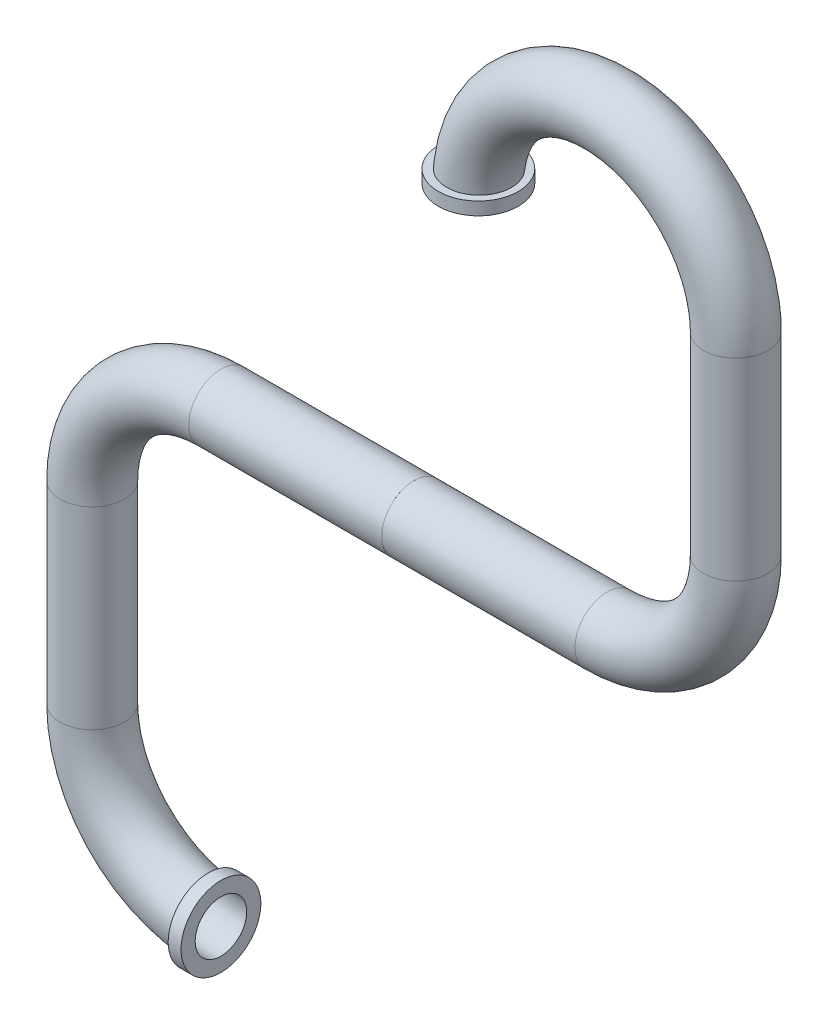
ISO-10303-21;
HEADER;
FILE_DESCRIPTION(('STEP AP214'),'2;1');
FILE_NAME('part.step','',(''),(''),'','','');
FILE_SCHEMA(('AUTOMOTIVE_DESIGN { 1 0 10303 214 1 1 1 1 }'));
ENDSEC;
DATA;
#1=APPLICATION_CONTEXT('core data for automotive mechanical design processes');
#2=APPLICATION_PROTOCOL_DEFINITION('international standard','automotive_design',2000,#1);
#3=PRODUCT_CONTEXT('',#1,'mechanical');
#4=PRODUCT('Part','Part','',(#3));
#5=PRODUCT_RELATED_PRODUCT_CATEGORY('part','',(#4));
#6=PRODUCT_DEFINITION_FORMATION('','',#4);
#7=PRODUCT_DEFINITION_CONTEXT('part definition',#1,'design');
#8=PRODUCT_DEFINITION('design','',#6,#7);
#9=PRODUCT_DEFINITION_SHAPE('','',#8);
#10=(LENGTH_UNIT() NAMED_UNIT(*) SI_UNIT(.MILLI.,.METRE.));
#11=(NAMED_UNIT(*) PLANE_ANGLE_UNIT() SI_UNIT($,.RADIAN.));
#12=(NAMED_UNIT(*) SI_UNIT($,.STERADIAN.) SOLID_ANGLE_UNIT());
#13=UNCERTAINTY_MEASURE_WITH_UNIT(LENGTH_MEASURE(1.E-05),#10,'distance_accuracy_value','');
#14=(GEOMETRIC_REPRESENTATION_CONTEXT(3) GLOBAL_UNCERTAINTY_ASSIGNED_CONTEXT((#13)) GLOBAL_UNIT_ASSIGNED_CONTEXT((#10,
#11,#12)) REPRESENTATION_CONTEXT('',''));
#15=CARTESIAN_POINT('',(0.,0.,0.));
#16=DIRECTION('',(0.,0.,1.));
#17=DIRECTION('',(1.,0.,0.));
#18=AXIS2_PLACEMENT_3D('',#15,#16,#17);
#19=CARTESIAN_POINT('',(-1.,-5.,0.));
#20=DIRECTION('',(0.,0.,1.));
#21=DIRECTION('',(-1.,0.,0.));
#22=AXIS2_PLACEMENT_3D('',#19,#20,#21);
#23=TOROIDAL_SURFACE('',#22,1.,0.25);
#24=CARTESIAN_POINT('',(-2.,-5.,0.));
#25=DIRECTION('',(0.,1.,0.));
#26=DIRECTION('',(1.,0.,0.));
#27=AXIS2_PLACEMENT_3D('',#24,#25,#26);
#28=CIRCLE('',#27,0.25);
#29=CARTESIAN_POINT('',(-1.75,-5.,0.));
#30=VERTEX_POINT('',#29);
#31=EDGE_CURVE('E69',#30,#30,#28,.T.);
#32=ORIENTED_EDGE('',*,*,#31,.F.);
#33=EDGE_LOOP('',(#32));
#34=FACE_BOUND('',#33,.T.);
#35=CARTESIAN_POINT('',(-1.1,-5.79859890368239,0.156239637939032));
#36=CARTESIAN_POINT('',(-1.1,-5.80748461825524,0.167252077609556));
#37=CARTESIAN_POINT('',(-1.1,-5.81731154482602,0.177518916216268));
#38=CARTESIAN_POINT('',(-1.1,-5.83855979360369,0.19626373386054));
#39=CARTESIAN_POINT('',(-1.1,-5.84998316824432,0.204739374280286));
#40=CARTESIAN_POINT('',(-1.1,-5.87408196910666,0.219650591642867));
#41=CARTESIAN_POINT('',(-1.1,-5.886756519343,0.22608758280258));
#42=CARTESIAN_POINT('',(-1.1,-5.91300023448786,0.236747922206662));
#43=CARTESIAN_POINT('',(-1.1,-5.92656916374023,0.240971850957401));
#44=CARTESIAN_POINT('',(-1.1,-5.95426609808908,0.247100376432837));
#45=CARTESIAN_POINT('',(-1.1,-5.96839572582249,0.248997644239239));
#46=CARTESIAN_POINT('',(-1.1,-5.99677370794496,0.250392904432415));
#47=CARTESIAN_POINT('',(-1.1,-6.01102206788375,0.249890784032795));
#48=CARTESIAN_POINT('',(-1.1,-6.03922913334701,0.246498215551292));
#49=CARTESIAN_POINT('',(-1.1,-6.0531878915475,0.243608205779817));
#50=CARTESIAN_POINT('',(-1.1,-6.08041932555233,0.235518387043977));
#51=CARTESIAN_POINT('',(-1.1,-6.09369201220857,0.230318614626648));
#52=CARTESIAN_POINT('',(-1.1,-6.11913001861259,0.217773097139474));
#53=CARTESIAN_POINT('',(-1.1,-6.13129864492456,0.210434057268859));
#54=CARTESIAN_POINT('',(-1.1,-6.15422440361082,0.193809388757354));
#55=CARTESIAN_POINT('',(-1.1,-6.16498156794405,0.184523804203341));
#56=CARTESIAN_POINT('',(-1.1,-6.18473296660521,0.164309957154052));
#57=CARTESIAN_POINT('',(-1.1,-6.19373414042714,0.153388475286201));
#58=CARTESIAN_POINT('',(-1.1,-6.20976742880129,0.130184858647969));
#59=CARTESIAN_POINT('',(-1.1,-6.2167995799634,0.117902749181559));
#60=CARTESIAN_POINT('',(-1.1,-6.22866989147601,0.0923732303855355));
#61=CARTESIAN_POINT('',(-1.1,-6.23351568693935,0.079129370795629));
#62=CARTESIAN_POINT('',(-1.1,-6.24090948117469,0.0520150874536668));
#63=CARTESIAN_POINT('',(-1.1,-6.24345751315272,0.0381446727592879));
#64=CARTESIAN_POINT('',(-1.1,-6.24617903253143,0.0102038849674102));
#65=CARTESIAN_POINT('',(-1.1,-6.24635775803878,-0.00386597816707667));
#66=CARTESIAN_POINT('',(-1.1,-6.2443490557881,-0.031835709221199));
#67=CARTESIAN_POINT('',(-1.1,-6.24216164206245,-0.0457355781484911));
#68=CARTESIAN_POINT('',(-1.1,-6.23548566564956,-0.0729628531749742));
#69=CARTESIAN_POINT('',(-1.1,-6.23099839651049,-0.0862905765141949));
#70=CARTESIAN_POINT('',(-1.1,-6.21985250641525,-0.112004722408374));
#71=CARTESIAN_POINT('',(-1.1,-6.2131938798134,-0.124391142515778));
#72=CARTESIAN_POINT('',(-1.1,-6.19788731542389,-0.147887218294693));
#73=CARTESIAN_POINT('',(-1.1,-6.18923708938564,-0.158995383124068));
#74=CARTESIAN_POINT('',(-1.1,-6.17019911655826,-0.179606640126383));
#75=CARTESIAN_POINT('',(-1.1,-6.15981135014478,-0.189109714168483));
#76=CARTESIAN_POINT('',(-1.1,-6.13756371948689,-0.20626946017412));
#77=CARTESIAN_POINT('',(-1.1,-6.1256999380033,-0.21392105304271));
#78=CARTESIAN_POINT('',(-1.1,-6.1008600065118,-0.227132541762682));
#79=CARTESIAN_POINT('',(-1.1,-6.08788383586549,-0.232692398795326));
#80=CARTESIAN_POINT('',(-1.1,-6.06113487356717,-0.241585432017922));
#81=CARTESIAN_POINT('',(-1.1,-6.04735924079537,-0.244910062193764));
#82=CARTESIAN_POINT('',(-1.1,-6.01944604647422,-0.249209299271455));
#83=CARTESIAN_POINT('',(-1.1,-6.00530847649481,-0.250183851386056));
#84=CARTESIAN_POINT('',(-1.1,-5.9770136765723,-0.249758171980902));
#85=CARTESIAN_POINT('',(-1.1,-5.96285658644129,-0.248348625861448));
#86=CARTESIAN_POINT('',(-1.1,-5.93497822630541,-0.243178774257271));
#87=CARTESIAN_POINT('',(-1.1,-5.92125696445682,-0.239418424805888));
#88=CARTESIAN_POINT('',(-1.1,-5.89460613735038,-0.229641253917755));
#89=CARTESIAN_POINT('',(-1.1,-5.88167853001149,-0.223619093935796));
#90=CARTESIAN_POINT('',(-1.1,-5.85701911324203,-0.209487505095448));
#91=CARTESIAN_POINT('',(-1.1,-5.8452873095212,-0.201378066271353));
#92=CARTESIAN_POINT('',(-1.1,-5.82337073898221,-0.183309172670582));
#93=CARTESIAN_POINT('',(-1.1,-5.81318412058785,-0.173351964393614));
#94=CARTESIAN_POINT('',(-1.1,-5.79463870405255,-0.151859949096213));
#95=CARTESIAN_POINT('',(-1.1,-5.78627985742117,-0.140325183941277));
#96=CARTESIAN_POINT('',(-1.1,-5.77168127958962,-0.116074864617476));
#97=CARTESIAN_POINT('',(-1.1,-5.76542965254311,-0.103366473106763));
#98=CARTESIAN_POINT('',(-1.1,-5.75516854334937,-0.0770751991823504));
#99=CARTESIAN_POINT('',(-1.1,-5.75115885665188,-0.0634923966743455));
#100=CARTESIAN_POINT('',(-1.1,-5.74552688282323,-0.035954544226516));
#101=CARTESIAN_POINT('',(-1.1,-5.74388566967865,-0.0220033627581954));
#102=CARTESIAN_POINT('',(-1.1,-5.74298034692899,0.00597955267886069));
#103=CARTESIAN_POINT('',(-1.1,-5.74371675742366,0.0200113036018034));
#104=CARTESIAN_POINT('',(-1.1,-5.74753647692591,0.0476924426773993));
#105=CARTESIAN_POINT('',(-1.1,-5.75061036534622,0.0613431382070314));
#106=CARTESIAN_POINT('',(-1.1,-5.7589995811081,0.0879247327921834));
#107=CARTESIAN_POINT('',(-1.1,-5.76431221334144,0.10085647623827));
#108=CARTESIAN_POINT('',(-1.1,-5.77456413039254,0.120867695525481));
#109=CARTESIAN_POINT('',(-1.1,-5.7788601779382,0.128284026486018));
#110=CARTESIAN_POINT('',(-1.1,-5.78818888620585,0.142637803870604));
#111=CARTESIAN_POINT('',(-1.1,-5.79322154516689,0.149575251439416));
#112=CARTESIAN_POINT('',(-1.1,-5.79859890368239,0.156239637939032));
#113=B_SPLINE_CURVE_WITH_KNOTS('',3,(#35,#36,#37,#38,#39,#40,#41,#42,#43,#44,#45,#46,#47,#48,
#49,#50,#51,#52,#53,#54,#55,#56,#57,#58,#59,#60,#61,#62,#63,#64,#65,#66,#67,#68,#69,#70,#71,#72,
#73,#74,#75,#76,#77,#78,#79,#80,#81,#82,#83,#84,#85,#86,#87,#88,#89,#90,#91,#92,#93,#94,#95,#96,
#97,#98,#99,#100,#101,#102,#103,#104,#105,#106,#107,#108,#109,#110,#111,#112),.UNSPECIFIED.,.T.,
.F.,(4,2,2,2,2,2,2,2,2,2,2,2,2,2,2,2,2,2,2,2,2,2,2,2,2,2,2,2,2,2,2,2,2,2,2,2,2,2,4),(0.,
0.0424192772184811,0.0848936001837856,0.127338393721263,0.16977204802275,0.212339026654769,
0.254908006223218,0.297469173753552,0.340029667868764,0.382458171419216,0.424885714119334,
0.467142031024321,0.509397562208715,0.551504365817851,0.593610560912517,0.635623651286504,
0.677636492503143,0.719625729586843,0.761615075846239,0.803652908716626,0.845691216407668,
0.887843570926039,0.929996707675383,0.972310107021949,1.01462449280908,1.05710458176961,
1.09958546525149,1.14216725288102,1.18474924382094,1.22727979920904,1.26980922613231,
1.3120943759003,1.35437566702383,1.39631718923709,1.43826788668425,1.48005040315259,
1.52178276285504,1.54745365347394,1.57312448272488),.UNSPECIFIED.);
#114=CARTESIAN_POINT('',(-1.1,-5.79859890368239,0.156239637939032));
#115=VERTEX_POINT('',#114);
#116=EDGE_CURVE('E12',#115,#115,#113,.T.);
#117=ORIENTED_EDGE('',*,*,#116,.F.);
#118=EDGE_LOOP('',(#117));
#119=FACE_BOUND('',#118,.T.);
#120=ADVANCED_FACE('F39',(#34,#119),#23,.T.);
#121=CARTESIAN_POINT('',(0.5,-5.,0.));
#122=DIRECTION('',(1.,0.,0.));
#123=DIRECTION('',(0.,0.,1.));
#124=AXIS2_PLACEMENT_3D('',#121,#122,#123);
#125=PLANE('',#124);
#126=CARTESIAN_POINT('',(0.5,-2.5,0.));
#127=DIRECTION('',(1.,0.,0.));
#128=DIRECTION('',(0.,0.,1.));
#129=AXIS2_PLACEMENT_3D('',#126,#127,#128);
#130=CIRCLE('',#129,0.2);
#131=CARTESIAN_POINT('',(0.5,-2.5,0.2));
#132=VERTEX_POINT('',#131);
#133=EDGE_CURVE('E59',#132,#132,#130,.F.);
#134=ORIENTED_EDGE('',*,*,#133,.T.);
#135=EDGE_LOOP('',(#134));
#136=FACE_BOUND('',#135,.T.);
#137=CARTESIAN_POINT('',(0.5,-2.5,0.));
#138=DIRECTION('',(1.,0.,0.));
#139=DIRECTION('',(0.,0.,1.));
#140=AXIS2_PLACEMENT_3D('',#137,#138,#139);
#141=CIRCLE('',#140,0.25);
#142=CARTESIAN_POINT('',(0.5,-2.5,0.25));
#143=VERTEX_POINT('',#142);
#144=EDGE_CURVE('E54',#143,#143,#141,.F.);
#145=ORIENTED_EDGE('',*,*,#144,.F.);
#146=EDGE_LOOP('',(#145));
#147=FACE_BOUND('',#146,.T.);
#148=ADVANCED_FACE('F116',(#136,#147),#125,.T.);
#149=CARTESIAN_POINT('',(-1.,-2.5,0.));
#150=DIRECTION('',(1.,0.,0.));
#151=DIRECTION('',(0.,-1.,0.));
#152=AXIS2_PLACEMENT_3D('',#149,#150,#151);
#153=CYLINDRICAL_SURFACE('',#152,0.25);
#154=CARTESIAN_POINT('',(-1.,-2.5,0.));
#155=DIRECTION('',(1.,0.,0.));
#156=DIRECTION('',(0.,-1.,0.));
#157=AXIS2_PLACEMENT_3D('',#154,#155,#156);
#158=CIRCLE('',#157,0.25);
#159=CARTESIAN_POINT('',(-1.,-2.25,0.));
#160=VERTEX_POINT('',#159);
#161=EDGE_CURVE('E78',#160,#160,#158,.T.);
#162=ORIENTED_EDGE('',*,*,#161,.T.);
#163=EDGE_LOOP('',(#162));
#164=FACE_BOUND('',#163,.T.);
#165=ORIENTED_EDGE('',*,*,#144,.T.);
#166=EDGE_LOOP('',(#165));
#167=FACE_BOUND('',#166,.T.);
#168=ADVANCED_FACE('F121',(#164,#167),#153,.T.);
#169=CARTESIAN_POINT('',(-1.,-2.5,0.));
#170=DIRECTION('',(1.,0.,0.));
#171=DIRECTION('',(0.,-1.,0.));
#172=AXIS2_PLACEMENT_3D('',#169,#170,#171);
#173=CYLINDRICAL_SURFACE('',#172,0.2);
#174=CARTESIAN_POINT('',(-1.,-2.5,0.));
#175=DIRECTION('',(1.,0.,0.));
#176=DIRECTION('',(0.,0.,-1.));
#177=AXIS2_PLACEMENT_3D('',#174,#175,#176);
#178=CIRCLE('',#177,0.2);
#179=CARTESIAN_POINT('',(-1.,-2.3,0.));
#180=VERTEX_POINT('',#179);
#181=EDGE_CURVE('E50',#180,#180,#178,.T.);
#182=ORIENTED_EDGE('',*,*,#181,.F.);
#183=EDGE_LOOP('',(#182));
#184=FACE_BOUND('',#183,.T.);
#185=ORIENTED_EDGE('',*,*,#133,.F.);
#186=EDGE_LOOP('',(#185));
#187=FACE_BOUND('',#186,.T.);
#188=ADVANCED_FACE('F41',(#184,#187),#173,.F.);
#189=CARTESIAN_POINT('',(-1.,-5.,0.));
#190=DIRECTION('',(1.,0.,0.));
#191=DIRECTION('',(0.,0.,1.));
#192=AXIS2_PLACEMENT_3D('',#189,#190,#191);
#193=PLANE('',#192);
#194=CARTESIAN_POINT('',(-1.,-6.,0.));
#195=DIRECTION('',(1.,0.,0.));
#196=DIRECTION('',(0.,0.,1.));
#197=AXIS2_PLACEMENT_3D('',#194,#195,#196);
#198=CIRCLE('',#197,0.31);
#199=CARTESIAN_POINT('',(-1.,-6.,0.309999999999976));
#200=VERTEX_POINT('',#199);
#201=EDGE_CURVE('E86',#200,#200,#198,.T.);
#202=ORIENTED_EDGE('',*,*,#201,.T.);
#203=EDGE_LOOP('',(#202));
#204=FACE_BOUND('',#203,.T.);
#205=CARTESIAN_POINT('',(-1.,-6.,0.));
#206=DIRECTION('',(1.,0.,0.));
#207=DIRECTION('',(0.,0.,1.));
#208=AXIS2_PLACEMENT_3D('',#205,#206,#207);
#209=CIRCLE('',#208,0.2);
#210=CARTESIAN_POINT('',(-1.,-6.2,0.));
#211=VERTEX_POINT('',#210);
#212=EDGE_CURVE('E62',#211,#211,#209,.T.);
#213=ORIENTED_EDGE('',*,*,#212,.F.);
#214=EDGE_LOOP('',(#213));
#215=FACE_BOUND('',#214,.T.);
#216=ADVANCED_FACE('F110',(#204,#215),#193,.T.);
#217=CARTESIAN_POINT('',(-2.,-5.,0.));
#218=DIRECTION('',(0.,1.,0.));
#219=DIRECTION('',(1.,0.,0.));
#220=AXIS2_PLACEMENT_3D('',#217,#218,#219);
#221=CYLINDRICAL_SURFACE('',#220,0.25);
#222=ORIENTED_EDGE('',*,*,#31,.T.);
#223=EDGE_LOOP('',(#222));
#224=FACE_BOUND('',#223,.T.);
#225=CARTESIAN_POINT('',(-2.,-3.5,0.));
#226=DIRECTION('',(0.,-1.,0.));
#227=DIRECTION('',(-1.,0.,0.));
#228=AXIS2_PLACEMENT_3D('',#225,#226,#227);
#229=CIRCLE('',#228,0.25);
#230=CARTESIAN_POINT('',(-2.25,-3.5,0.));
#231=VERTEX_POINT('',#230);
#232=EDGE_CURVE('E65',#231,#231,#229,.F.);
#233=ORIENTED_EDGE('',*,*,#232,.F.);
#234=EDGE_LOOP('',(#233));
#235=FACE_BOUND('',#234,.T.);
#236=ADVANCED_FACE('F123',(#224,#235),#221,.T.);
#237=CARTESIAN_POINT('',(-1.,-3.5,0.));
#238=DIRECTION('',(0.,0.,-1.));
#239=DIRECTION('',(1.,0.,0.));
#240=AXIS2_PLACEMENT_3D('',#237,#238,#239);
#241=TOROIDAL_SURFACE('',#240,1.,0.25);
#242=CARTESIAN_POINT('',(-1.,-3.5,0.));
#243=DIRECTION('',(0.,0.,-1.));
#244=DIRECTION('',(1.,0.,0.));
#245=AXIS2_PLACEMENT_3D('',#242,#243,#244);
#246=CIRCLE('',#245,1.25);
#247=EDGE_CURVE('',#231,#160,#246,.T.);
#248=ORIENTED_EDGE('',*,*,#232,.T.);
#249=ORIENTED_EDGE('',*,*,#161,.F.);
#250=ORIENTED_EDGE('',*,*,#247,.T.);
#251=ORIENTED_EDGE('',*,*,#247,.F.);
#252=EDGE_LOOP('',(#248,#250,#249,#251));
#253=FACE_BOUND('',#252,.T.);
#254=ADVANCED_FACE('F111',(#253),#241,.T.);
#255=CARTESIAN_POINT('',(-2.,-5.,0.));
#256=DIRECTION('',(0.,1.,0.));
#257=DIRECTION('',(1.,0.,0.));
#258=AXIS2_PLACEMENT_3D('',#255,#256,#257);
#259=CYLINDRICAL_SURFACE('',#258,0.2);
#260=CARTESIAN_POINT('',(-2.,-5.,0.));
#261=DIRECTION('',(0.,1.,0.));
#262=DIRECTION('',(0.,0.,-1.));
#263=AXIS2_PLACEMENT_3D('',#260,#261,#262);
#264=CIRCLE('',#263,0.2);
#265=CARTESIAN_POINT('',(-2.2,-5.,0.));
#266=VERTEX_POINT('',#265);
#267=EDGE_CURVE('E84',#266,#266,#264,.T.);
#268=ORIENTED_EDGE('',*,*,#267,.F.);
#269=EDGE_LOOP('',(#268));
#270=FACE_BOUND('',#269,.T.);
#271=CARTESIAN_POINT('',(-2.,-3.5,0.));
#272=DIRECTION('',(0.,1.,0.));
#273=DIRECTION('',(0.,0.,-1.));
#274=AXIS2_PLACEMENT_3D('',#271,#272,#273);
#275=CIRCLE('',#274,0.2);
#276=CARTESIAN_POINT('',(-2.2,-3.5,0.));
#277=VERTEX_POINT('',#276);
#278=EDGE_CURVE('E74',#277,#277,#275,.T.);
#279=ORIENTED_EDGE('',*,*,#278,.T.);
#280=EDGE_LOOP('',(#279));
#281=FACE_BOUND('',#280,.T.);
#282=ADVANCED_FACE('F98',(#270,#281),#259,.F.);
#283=CARTESIAN_POINT('',(-1.,-3.5,0.));
#284=DIRECTION('',(0.,0.,-1.));
#285=DIRECTION('',(1.,0.,0.));
#286=AXIS2_PLACEMENT_3D('',#283,#284,#285);
#287=TOROIDAL_SURFACE('',#286,1.,0.2);
#288=CARTESIAN_POINT('',(-1.,-3.5,0.));
#289=DIRECTION('',(0.,0.,-1.));
#290=DIRECTION('',(1.,0.,0.));
#291=AXIS2_PLACEMENT_3D('',#288,#289,#290);
#292=CIRCLE('',#291,1.2);
#293=EDGE_CURVE('',#277,#180,#292,.T.);
#294=ORIENTED_EDGE('',*,*,#278,.F.);
#295=ORIENTED_EDGE('',*,*,#181,.T.);
#296=ORIENTED_EDGE('',*,*,#293,.T.);
#297=ORIENTED_EDGE('',*,*,#293,.F.);
#298=EDGE_LOOP('',(#294,#296,#295,#297));
#299=FACE_BOUND('',#298,.T.);
#300=ADVANCED_FACE('F100',(#299),#287,.F.);
#301=CARTESIAN_POINT('',(-1.,-5.,0.));
#302=DIRECTION('',(0.,0.,1.));
#303=DIRECTION('',(-1.,0.,0.));
#304=AXIS2_PLACEMENT_3D('',#301,#302,#303);
#305=TOROIDAL_SURFACE('',#304,1.,0.2);
#306=CARTESIAN_POINT('',(-1.,-5.,0.));
#307=DIRECTION('',(0.,0.,1.));
#308=DIRECTION('',(-1.,0.,0.));
#309=AXIS2_PLACEMENT_3D('',#306,#307,#308);
#310=CIRCLE('',#309,1.2);
#311=EDGE_CURVE('',#266,#211,#310,.T.);
#312=ORIENTED_EDGE('',*,*,#267,.T.);
#313=ORIENTED_EDGE('',*,*,#212,.T.);
#314=ORIENTED_EDGE('',*,*,#311,.T.);
#315=ORIENTED_EDGE('',*,*,#311,.F.);
#316=EDGE_LOOP('',(#312,#314,#313,#315));
#317=FACE_BOUND('',#316,.T.);
#318=ADVANCED_FACE('F102',(#317),#305,.F.);
#319=CARTESIAN_POINT('',(-1.1,-6.,0.));
#320=DIRECTION('',(1.,0.,0.));
#321=DIRECTION('',(0.,0.,1.));
#322=AXIS2_PLACEMENT_3D('',#319,#320,#321);
#323=PLANE('',#322);
#324=CARTESIAN_POINT('',(-1.1,-6.,0.));
#325=DIRECTION('',(1.,0.,0.));
#326=DIRECTION('',(0.,0.,1.));
#327=AXIS2_PLACEMENT_3D('',#324,#325,#326);
#328=CIRCLE('',#327,0.31);
#329=CARTESIAN_POINT('',(-1.1,-6.,0.309999999999976));
#330=VERTEX_POINT('',#329);
#331=EDGE_CURVE('E80',#330,#330,#328,.T.);
#332=ORIENTED_EDGE('',*,*,#331,.F.);
#333=EDGE_LOOP('',(#332));
#334=FACE_BOUND('',#333,.T.);
#335=ORIENTED_EDGE('',*,*,#116,.T.);
#336=EDGE_LOOP('',(#335));
#337=FACE_BOUND('',#336,.T.);
#338=ADVANCED_FACE('F108',(#334,#337),#323,.F.);
#339=CARTESIAN_POINT('',(-1.1,-6.,0.));
#340=DIRECTION('',(1.,0.,0.));
#341=DIRECTION('',(0.,0.,1.));
#342=AXIS2_PLACEMENT_3D('',#339,#340,#341);
#343=CYLINDRICAL_SURFACE('',#342,0.31);
#344=ORIENTED_EDGE('',*,*,#331,.T.);
#345=EDGE_LOOP('',(#344));
#346=FACE_BOUND('',#345,.T.);
#347=ORIENTED_EDGE('',*,*,#201,.F.);
#348=EDGE_LOOP('',(#347));
#349=FACE_BOUND('',#348,.T.);
#350=ADVANCED_FACE('F208',(#346,#349),#343,.T.);
#351=CLOSED_SHELL('',(#120,#148,#168,#188,#216,#236,#254,#282,#300,#318,#338,#350));
#352=MANIFOLD_SOLID_BREP('B2',#351);
#353=CARTESIAN_POINT('',(0.5,0.,0.));
#354=DIRECTION('',(1.,0.,0.));
#355=DIRECTION('',(0.,0.,-1.));
#356=AXIS2_PLACEMENT_3D('',#353,#354,#355);
#357=PLANE('',#356);
#358=CARTESIAN_POINT('',(0.5,-2.5,0.));
#359=DIRECTION('',(1.,0.,0.));
#360=DIRECTION('',(0.,0.,-1.));
#361=AXIS2_PLACEMENT_3D('',#358,#359,#360);
#362=CIRCLE('',#361,0.25);
#363=CARTESIAN_POINT('',(0.5,-2.5,-0.25));
#364=VERTEX_POINT('',#363);
#365=EDGE_CURVE('E38',#364,#364,#362,.F.);
#366=ORIENTED_EDGE('',*,*,#365,.T.);
#367=EDGE_LOOP('',(#366));
#368=FACE_BOUND('',#367,.T.);
#369=CARTESIAN_POINT('',(0.5,-2.5,0.));
#370=DIRECTION('',(1.,0.,0.));
#371=DIRECTION('',(0.,0.,-1.));
#372=AXIS2_PLACEMENT_3D('',#369,#370,#371);
#373=CIRCLE('',#372,0.2);
#374=CARTESIAN_POINT('',(0.5,-2.5,-0.2));
#375=VERTEX_POINT('',#374);
#376=EDGE_CURVE('E239',#375,#375,#373,.F.);
#377=ORIENTED_EDGE('',*,*,#376,.F.);
#378=EDGE_LOOP('',(#377));
#379=FACE_BOUND('',#378,.T.);
#380=ADVANCED_FACE('F233',(#368,#379),#357,.F.);
#381=CARTESIAN_POINT('',(-1.,-2.5,0.));
#382=DIRECTION('',(1.,0.,0.));
#383=DIRECTION('',(0.,1.,0.));
#384=AXIS2_PLACEMENT_3D('',#381,#382,#383);
#385=CYLINDRICAL_SURFACE('',#384,0.25);
#386=ORIENTED_EDGE('',*,*,#365,.F.);
#387=EDGE_LOOP('',(#386));
#388=FACE_BOUND('',#387,.T.);
#389=CARTESIAN_POINT('',(2.,-2.5,0.));
#390=DIRECTION('',(1.,0.,0.));
#391=DIRECTION('',(0.,1.,0.));
#392=AXIS2_PLACEMENT_3D('',#389,#390,#391);
#393=CIRCLE('',#392,0.25);
#394=CARTESIAN_POINT('',(2.,-2.75,0.));
#395=VERTEX_POINT('',#394);
#396=EDGE_CURVE('E243',#395,#395,#393,.T.);
#397=ORIENTED_EDGE('',*,*,#396,.F.);
#398=EDGE_LOOP('',(#397));
#399=FACE_BOUND('',#398,.T.);
#400=ADVANCED_FACE('F276',(#388,#399),#385,.T.);
#401=CARTESIAN_POINT('',(1.,0.,0.));
#402=DIRECTION('',(0.,1.,0.));
#403=DIRECTION('',(0.,0.,1.));
#404=AXIS2_PLACEMENT_3D('',#401,#402,#403);
#405=PLANE('',#404);
#406=CARTESIAN_POINT('',(1.,0.,0.));
#407=DIRECTION('',(0.,-1.,0.));
#408=DIRECTION('',(0.,0.,1.));
#409=AXIS2_PLACEMENT_3D('',#406,#407,#408);
#410=CIRCLE('',#409,0.2);
#411=CARTESIAN_POINT('',(0.800000000000001,0.,0.));
#412=VERTEX_POINT('',#411);
#413=EDGE_CURVE('E257',#412,#412,#410,.T.);
#414=ORIENTED_EDGE('',*,*,#413,.F.);
#415=EDGE_LOOP('',(#414));
#416=FACE_BOUND('',#415,.T.);
#417=CARTESIAN_POINT('',(1.,0.,0.));
#418=DIRECTION('',(0.,-1.,0.));
#419=DIRECTION('',(0.,0.,1.));
#420=AXIS2_PLACEMENT_3D('',#417,#418,#419);
#421=CIRCLE('',#420,0.31);
#422=CARTESIAN_POINT('',(1.,0.,0.31));
#423=VERTEX_POINT('',#422);
#424=EDGE_CURVE('E320',#423,#423,#421,.T.);
#425=ORIENTED_EDGE('',*,*,#424,.T.);
#426=EDGE_LOOP('',(#425));
#427=FACE_BOUND('',#426,.T.);
#428=ADVANCED_FACE('F278',(#416,#427),#405,.F.);
#429=CARTESIAN_POINT('',(2.,0.,0.));
#430=DIRECTION('',(0.,0.,-1.));
#431=DIRECTION('',(1.,0.,0.));
#432=AXIS2_PLACEMENT_3D('',#429,#430,#431);
#433=TOROIDAL_SURFACE('',#432,1.,0.2);
#434=CARTESIAN_POINT('',(3.,0.,0.));
#435=DIRECTION('',(0.,1.,0.));
#436=DIRECTION('',(0.,0.,1.));
#437=AXIS2_PLACEMENT_3D('',#434,#435,#436);
#438=CIRCLE('',#437,0.2);
#439=CARTESIAN_POINT('',(3.2,0.,0.));
#440=VERTEX_POINT('',#439);
#441=EDGE_CURVE('E327',#440,#440,#438,.T.);
#442=CARTESIAN_POINT('',(2.,0.,0.));
#443=DIRECTION('',(0.,0.,-1.));
#444=DIRECTION('',(1.,0.,0.));
#445=AXIS2_PLACEMENT_3D('',#442,#443,#444);
#446=CIRCLE('',#445,1.2);
#447=EDGE_CURVE('',#412,#440,#446,.T.);
#448=ORIENTED_EDGE('',*,*,#413,.T.);
#449=ORIENTED_EDGE('',*,*,#441,.F.);
#450=ORIENTED_EDGE('',*,*,#447,.T.);
#451=ORIENTED_EDGE('',*,*,#447,.F.);
#452=EDGE_LOOP('',(#448,#450,#449,#451));
#453=FACE_BOUND('',#452,.T.);
#454=ADVANCED_FACE('F285',(#453),#433,.F.);
#455=CARTESIAN_POINT('',(3.,0.,0.));
#456=DIRECTION('',(0.,-1.,0.));
#457=DIRECTION('',(-1.,0.,0.));
#458=AXIS2_PLACEMENT_3D('',#455,#456,#457);
#459=CYLINDRICAL_SURFACE('',#458,0.2);
#460=ORIENTED_EDGE('',*,*,#441,.T.);
#461=EDGE_LOOP('',(#460));
#462=FACE_BOUND('',#461,.T.);
#463=CARTESIAN_POINT('',(3.,-1.5,0.));
#464=DIRECTION('',(0.,1.,0.));
#465=DIRECTION('',(0.,0.,1.));
#466=AXIS2_PLACEMENT_3D('',#463,#464,#465);
#467=CIRCLE('',#466,0.2);
#468=CARTESIAN_POINT('',(3.2,-1.5,0.));
#469=VERTEX_POINT('',#468);
#470=EDGE_CURVE('E330',#469,#469,#467,.T.);
#471=ORIENTED_EDGE('',*,*,#470,.F.);
#472=EDGE_LOOP('',(#471));
#473=FACE_BOUND('',#472,.T.);
#474=ADVANCED_FACE('F301',(#462,#473),#459,.F.);
#475=CARTESIAN_POINT('',(2.,-1.5,0.));
#476=DIRECTION('',(0.,0.,1.));
#477=DIRECTION('',(-1.,0.,0.));
#478=AXIS2_PLACEMENT_3D('',#475,#476,#477);
#479=TOROIDAL_SURFACE('',#478,1.,0.2);
#480=CARTESIAN_POINT('',(2.,-2.5,0.));
#481=DIRECTION('',(1.,0.,0.));
#482=DIRECTION('',(0.,0.,1.));
#483=AXIS2_PLACEMENT_3D('',#480,#481,#482);
#484=CIRCLE('',#483,0.2);
#485=CARTESIAN_POINT('',(2.,-2.7,0.));
#486=VERTEX_POINT('',#485);
#487=EDGE_CURVE('E333',#486,#486,#484,.T.);
#488=CARTESIAN_POINT('',(2.,-1.5,0.));
#489=DIRECTION('',(0.,0.,1.));
#490=DIRECTION('',(-1.,0.,0.));
#491=AXIS2_PLACEMENT_3D('',#488,#489,#490);
#492=CIRCLE('',#491,1.2);
#493=EDGE_CURVE('',#486,#469,#492,.T.);
#494=ORIENTED_EDGE('',*,*,#487,.F.);
#495=ORIENTED_EDGE('',*,*,#470,.T.);
#496=ORIENTED_EDGE('',*,*,#493,.T.);
#497=ORIENTED_EDGE('',*,*,#493,.F.);
#498=EDGE_LOOP('',(#494,#496,#495,#497));
#499=FACE_BOUND('',#498,.T.);
#500=ADVANCED_FACE('F275',(#499),#479,.F.);
#501=CARTESIAN_POINT('',(-1.,-2.5,0.));
#502=DIRECTION('',(1.,0.,0.));
#503=DIRECTION('',(0.,1.,0.));
#504=AXIS2_PLACEMENT_3D('',#501,#502,#503);
#505=CYLINDRICAL_SURFACE('',#504,0.2);
#506=ORIENTED_EDGE('',*,*,#376,.T.);
#507=EDGE_LOOP('',(#506));
#508=FACE_BOUND('',#507,.T.);
#509=ORIENTED_EDGE('',*,*,#487,.T.);
#510=EDGE_LOOP('',(#509));
#511=FACE_BOUND('',#510,.T.);
#512=ADVANCED_FACE('F272',(#508,#511),#505,.F.);
#513=CARTESIAN_POINT('',(1.,0.0999999999999996,0.));
#514=DIRECTION('',(0.,-1.,0.));
#515=DIRECTION('',(0.,0.,-1.));
#516=AXIS2_PLACEMENT_3D('',#513,#514,#515);
#517=CYLINDRICAL_SURFACE('',#516,0.31);
#518=CARTESIAN_POINT('',(1.,0.0999999999999996,0.));
#519=DIRECTION('',(0.,-1.,0.));
#520=DIRECTION('',(0.,0.,1.));
#521=AXIS2_PLACEMENT_3D('',#518,#519,#520);
#522=CIRCLE('',#521,0.31);
#523=CARTESIAN_POINT('',(1.,0.0999999999999996,0.31));
#524=VERTEX_POINT('',#523);
#525=EDGE_CURVE('E258',#524,#524,#522,.T.);
#526=ORIENTED_EDGE('',*,*,#525,.T.);
#527=EDGE_LOOP('',(#526));
#528=FACE_BOUND('',#527,.T.);
#529=ORIENTED_EDGE('',*,*,#424,.F.);
#530=EDGE_LOOP('',(#529));
#531=FACE_BOUND('',#530,.T.);
#532=ADVANCED_FACE('F274',(#528,#531),#517,.T.);
#533=CARTESIAN_POINT('',(1.,0.0999999999999996,0.));
#534=DIRECTION('',(0.,1.,0.));
#535=DIRECTION('',(0.,0.,1.));
#536=AXIS2_PLACEMENT_3D('',#533,#534,#535);
#537=PLANE('',#536);
#538=ORIENTED_EDGE('',*,*,#525,.F.);
#539=EDGE_LOOP('',(#538));
#540=FACE_BOUND('',#539,.T.);
#541=CARTESIAN_POINT('',(1.20140109631761,0.0999999999999994,-0.156239637939055));
#542=CARTESIAN_POINT('',(1.21019061571474,0.0999999999999994,-0.145344468335609));
#543=CARTESIAN_POINT('',(1.21807172210946,0.0999999999999994,-0.133703962300581));
#544=CARTESIAN_POINT('',(1.23177790310757,0.0999999999999994,-0.109257379143088));
#545=CARTESIAN_POINT('',(1.237600690406,0.0999999999999994,-0.096450025107835));
#546=CARTESIAN_POINT('',(1.24700765016561,0.0999999999999994,-0.0700386597896411));
#547=CARTESIAN_POINT('',(1.25059219436236,0.0999999999999994,-0.0564347812071185));
#548=CARTESIAN_POINT('',(1.25541318839992,0.0999999999999994,-0.0288206461573356));
#549=CARTESIAN_POINT('',(1.25665023046536,0.0999999999999994,-0.014810493090211));
#550=CARTESIAN_POINT('',(1.25674012956133,0.0999999999999994,0.0131538110387401));
#551=CARTESIAN_POINT('',(1.25560376128764,0.0999999999999994,0.0271079282969863));
#552=CARTESIAN_POINT('',(1.25100317267413,0.0999999999999994,0.0546272137432173));
#553=CARTESIAN_POINT('',(1.24753888231816,0.0999999999999994,0.0681923702197628));
#554=CARTESIAN_POINT('',(1.23838863374503,0.0999999999999994,0.0945453892648773));
#555=CARTESIAN_POINT('',(1.23270348712941,0.0999999999999994,0.107333533818285));
#556=CARTESIAN_POINT('',(1.21927977306228,0.0999999999999994,0.131782096781474));
#557=CARTESIAN_POINT('',(1.21154114762927,0.0999999999999994,0.143442483335476));
#558=CARTESIAN_POINT('',(1.19418083260693,0.0999999999999995,0.16538311643698));
#559=CARTESIAN_POINT('',(1.18454778916345,0.0999999999999995,0.175654378083549));
#560=CARTESIAN_POINT('',(1.16370586490868,0.0999999999999995,0.194449314988614));
#561=CARTESIAN_POINT('',(1.15249692087162,0.0999999999999995,0.202972920096664));
#562=CARTESIAN_POINT('',(1.12872743217782,0.0999999999999995,0.218098495866874));
#563=CARTESIAN_POINT('',(1.11615711045901,0.0999999999999995,0.224685104803622));
#564=CARTESIAN_POINT('',(1.09009255829582,0.0999999999999995,0.235665425768117));
#565=CARTESIAN_POINT('',(1.07659830142009,0.0999999999999995,0.240059075031189));
#566=CARTESIAN_POINT('',(1.0490037254833,0.0999999999999996,0.246545191192852));
#567=CARTESIAN_POINT('',(1.03490096979586,0.0999999999999996,0.248627297728038));
#568=CARTESIAN_POINT('',(1.00654593496887,0.0999999999999996,0.250394447161815));
#569=CARTESIAN_POINT('',(0.992293655189753,0.0999999999999996,0.250079479803207));
#570=CARTESIAN_POINT('',(0.964044783835867,0.0999999999999996,0.247058139402245));
#571=CARTESIAN_POINT('',(0.95004818958155,0.0999999999999996,0.244351791435899));
#572=CARTESIAN_POINT('',(0.922710586450209,0.0999999999999997,0.236620477359455));
#573=CARTESIAN_POINT('',(0.909369569109577,0.0999999999999997,0.23159554119143));
#574=CARTESIAN_POINT('',(0.883765586512359,0.0999999999999997,0.219384869006445));
#575=CARTESIAN_POINT('',(0.871499478830634,0.0999999999999997,0.212205722852414));
#576=CARTESIAN_POINT('',(0.848353160880975,0.0999999999999997,0.195882113872184));
#577=CARTESIAN_POINT('',(0.837472922002869,0.0999999999999997,0.186737691628039));
#578=CARTESIAN_POINT('',(0.817453819567474,0.0999999999999997,0.166782766405174));
#579=CARTESIAN_POINT('',(0.808308112284606,0.0999999999999997,0.155979129073377));
#580=CARTESIAN_POINT('',(0.791968057395513,0.0999999999999998,0.132985122648441));
#581=CARTESIAN_POINT('',(0.784773671079474,0.0999999999999998,0.120794781071202));
#582=CARTESIAN_POINT('',(0.772566712871766,0.0999999999999998,0.095420262938804));
#583=CARTESIAN_POINT('',(0.767546469379715,0.0999999999999998,0.0822397766594054));
#584=CARTESIAN_POINT('',(0.759795746832072,0.0999999999999998,0.0552219448415193));
#585=CARTESIAN_POINT('',(0.757065234762672,0.0999999999999998,0.0413846087766634));
#586=CARTESIAN_POINT('',(0.753976519279488,0.0999999999999998,0.013479573995303));
#587=CARTESIAN_POINT('',(0.753612942574423,0.0999999999999998,-0.000587530219673126));
#588=CARTESIAN_POINT('',(0.755254272349145,0.0999999999999998,-0.0285828177191339));
#589=CARTESIAN_POINT('',(0.757259164603744,0.0999999999999998,-0.0425110018374756));
#590=CARTESIAN_POINT('',(0.763577570254616,0.0999999999999998,-0.069824146498636));
#591=CARTESIAN_POINT('',(0.76788963229582,0.0999999999999998,-0.0832094428634802));
#592=CARTESIAN_POINT('',(0.778697386164953,0.0999999999999998,-0.109067212165587));
#593=CARTESIAN_POINT('',(0.785193080784411,0.0999999999999998,-0.121539683935882));
#594=CARTESIAN_POINT('',(0.800190008892191,0.0999999999999997,-0.145233133026621));
#595=CARTESIAN_POINT('',(0.808693418744189,0.0999999999999997,-0.156452732655624));
#596=CARTESIAN_POINT('',(0.827458597227383,0.0999999999999997,-0.177309784421281));
#597=CARTESIAN_POINT('',(0.837720388123736,0.0999999999999997,-0.18694721652102));
#598=CARTESIAN_POINT('',(0.859739463821489,0.0999999999999997,-0.20439458897411));
#599=CARTESIAN_POINT('',(0.871500649143087,0.0999999999999997,-0.212199606378334));
#600=CARTESIAN_POINT('',(0.896162545480009,0.0999999999999997,-0.225732886882564));
#601=CARTESIAN_POINT('',(0.909063279872268,0.0999999999999997,-0.231461107366438));
#602=CARTESIAN_POINT('',(0.935690177297002,0.0999999999999997,-0.240701650163389));
#603=CARTESIAN_POINT('',(0.949419285126398,0.0999999999999996,-0.244205486570355));
#604=CARTESIAN_POINT('',(0.977269513121592,0.0999999999999996,-0.248868281721869));
#605=CARTESIAN_POINT('',(0.991390626994743,0.0999999999999996,-0.250027278084741));
#606=CARTESIAN_POINT('',(1.01968231033146,0.0999999999999996,-0.249971637934856));
#607=CARTESIAN_POINT('',(1.03385286183813,0.0999999999999996,-0.248747884057992));
#608=CARTESIAN_POINT('',(1.06179290963795,0.0999999999999995,-0.243944388235435));
#609=CARTESIAN_POINT('',(1.07556229838005,0.0999999999999995,-0.240364020446176));
#610=CARTESIAN_POINT('',(1.10234573174545,0.0999999999999995,-0.230935097081438));
#611=CARTESIAN_POINT('',(1.1153574306868,0.0999999999999995,-0.225079887987269));
#612=CARTESIAN_POINT('',(1.14020018687569,0.0999999999999995,-0.211269182973001));
#613=CARTESIAN_POINT('',(1.15203262501892,0.0999999999999995,-0.203316184310893));
#614=CARTESIAN_POINT('',(1.17015055889538,0.0999999999999995,-0.188776882063845));
#615=CARTESIAN_POINT('',(1.17688861698793,0.0999999999999995,-0.182745072414765));
#616=CARTESIAN_POINT('',(1.18967760471602,0.0999999999999995,-0.169992202553551));
#617=CARTESIAN_POINT('',(1.19572853335573,0.0999999999999994,-0.163271141342544));
#618=CARTESIAN_POINT('',(1.20140109631761,0.0999999999999994,-0.156239637939055));
#619=B_SPLINE_CURVE_WITH_KNOTS('',3,(#541,#542,#543,#544,#545,#546,#547,#548,#549,#550,#551,
#552,#553,#554,#555,#556,#557,#558,#559,#560,#561,#562,#563,#564,#565,#566,#567,#568,#569,#570,
#571,#572,#573,#574,#575,#576,#577,#578,#579,#580,#581,#582,#583,#584,#585,#586,#587,#588,#589,
#590,#591,#592,#593,#594,#595,#596,#597,#598,#599,#600,#601,#602,#603,#604,#605,#606,#607,#608,
#609,#610,#611,#612,#613,#614,#615,#616,#617,#618),.UNSPECIFIED.,.T.,.F.,(4,2,2,2,2,2,2,2,2,2,2,
2,2,2,2,2,2,2,2,2,2,2,2,2,2,2,2,2,2,2,2,2,2,2,2,2,2,2,4),(0.,0.0419631052503928,
0.0839726964411998,0.125975308668973,0.167967323125762,0.209769118662524,0.251572171514233,
0.293359961905662,0.335148932332196,0.377196440897467,0.419245636907758,0.461619835954524,
0.503995247723258,0.54655982933734,0.589124593087474,0.631688910508933,0.6742526782734,
0.716687545691694,0.759121536933536,0.801384450217337,0.843646525038764,0.88575823574167,
0.927869339259047,0.969884810944665,1.01190003028372,1.05388885042508,1.09587772424463,
1.13791232469054,1.17994745743075,1.22209426111071,1.26424192959939,1.30654943795309,
1.34885626756105,1.39132529833847,1.43380561212635,1.47641112039157,1.51896613717817,
1.5460481653165,1.57313023270311),.UNSPECIFIED.);
#620=CARTESIAN_POINT('',(1.20140109631761,0.0999999999999994,-0.156239637939055));
#621=VERTEX_POINT('',#620);
#622=EDGE_CURVE('E250',#621,#621,#619,.T.);
#623=ORIENTED_EDGE('',*,*,#622,.T.);
#624=EDGE_LOOP('',(#623));
#625=FACE_BOUND('',#624,.T.);
#626=ADVANCED_FACE('F261',(#540,#625),#537,.T.);
#627=CARTESIAN_POINT('',(2.,0.,0.));
#628=DIRECTION('',(0.,0.,-1.));
#629=DIRECTION('',(1.,0.,0.));
#630=AXIS2_PLACEMENT_3D('',#627,#628,#629);
#631=TOROIDAL_SURFACE('',#630,1.,0.25);
#632=ORIENTED_EDGE('',*,*,#622,.F.);
#633=EDGE_LOOP('',(#632));
#634=FACE_BOUND('',#633,.T.);
#635=CARTESIAN_POINT('',(3.,0.,0.));
#636=DIRECTION('',(0.,1.,0.));
#637=DIRECTION('',(-1.,0.,0.));
#638=AXIS2_PLACEMENT_3D('',#635,#636,#637);
#639=CIRCLE('',#638,0.25);
#640=CARTESIAN_POINT('',(2.75,0.,0.));
#641=VERTEX_POINT('',#640);
#642=EDGE_CURVE('E259',#641,#641,#639,.T.);
#643=ORIENTED_EDGE('',*,*,#642,.T.);
#644=EDGE_LOOP('',(#643));
#645=FACE_BOUND('',#644,.T.);
#646=ADVANCED_FACE('F264',(#634,#645),#631,.T.);
#647=CARTESIAN_POINT('',(3.,0.,0.));
#648=DIRECTION('',(0.,-1.,0.));
#649=DIRECTION('',(-1.,0.,0.));
#650=AXIS2_PLACEMENT_3D('',#647,#648,#649);
#651=CYLINDRICAL_SURFACE('',#650,0.25);
#652=ORIENTED_EDGE('',*,*,#642,.F.);
#653=EDGE_LOOP('',(#652));
#654=FACE_BOUND('',#653,.T.);
#655=CARTESIAN_POINT('',(3.,-1.5,0.));
#656=DIRECTION('',(0.,-1.,0.));
#657=DIRECTION('',(1.,0.,0.));
#658=AXIS2_PLACEMENT_3D('',#655,#656,#657);
#659=CIRCLE('',#658,0.25);
#660=CARTESIAN_POINT('',(3.25,-1.5,0.));
#661=VERTEX_POINT('',#660);
#662=EDGE_CURVE('E247',#661,#661,#659,.F.);
#663=ORIENTED_EDGE('',*,*,#662,.T.);
#664=EDGE_LOOP('',(#663));
#665=FACE_BOUND('',#664,.T.);
#666=ADVANCED_FACE('F269',(#654,#665),#651,.T.);
#667=CARTESIAN_POINT('',(2.,-1.5,0.));
#668=DIRECTION('',(0.,0.,1.));
#669=DIRECTION('',(-1.,0.,0.));
#670=AXIS2_PLACEMENT_3D('',#667,#668,#669);
#671=TOROIDAL_SURFACE('',#670,1.,0.25);
#672=CARTESIAN_POINT('',(2.,-1.5,0.));
#673=DIRECTION('',(0.,0.,1.));
#674=DIRECTION('',(-1.,0.,0.));
#675=AXIS2_PLACEMENT_3D('',#672,#673,#674);
#676=CIRCLE('',#675,1.25);
#677=EDGE_CURVE('',#395,#661,#676,.T.);
#678=ORIENTED_EDGE('',*,*,#396,.T.);
#679=ORIENTED_EDGE('',*,*,#662,.F.);
#680=ORIENTED_EDGE('',*,*,#677,.T.);
#681=ORIENTED_EDGE('',*,*,#677,.F.);
#682=EDGE_LOOP('',(#678,#680,#679,#681));
#683=FACE_BOUND('',#682,.T.);
#684=ADVANCED_FACE('F280',(#683),#671,.T.);
#685=CLOSED_SHELL('',(#380,#400,#428,#454,#474,#500,#512,#532,#626,#646,#666,#684));
#686=MANIFOLD_SOLID_BREP('B7',#685);
#687=ADVANCED_BREP_SHAPE_REPRESENTATION('',(#18,#352,#686),#14);
#688=SHAPE_DEFINITION_REPRESENTATION(#9,#687);
ENDSEC;
END-ISO-10303-21;
